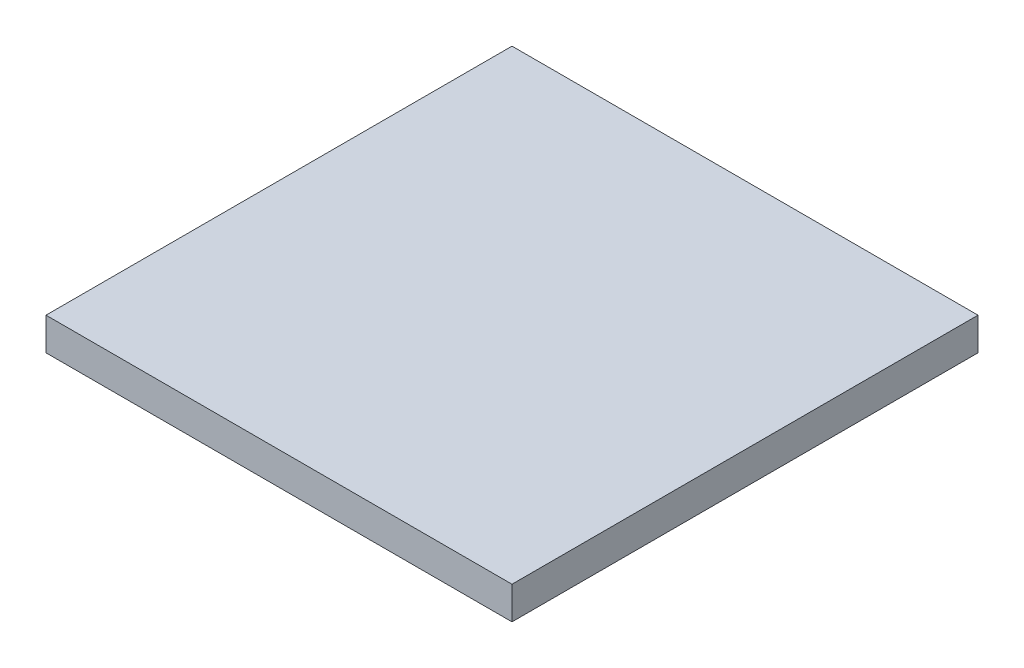
ISO-10303-21;
HEADER;
FILE_DESCRIPTION(('STEP AP214'),'2;1');
FILE_NAME('part.step','',(''),(''),'','','');
FILE_SCHEMA(('AUTOMOTIVE_DESIGN { 1 0 10303 214 1 1 1 1 }'));
ENDSEC;
DATA;
#1=APPLICATION_CONTEXT('core data for automotive mechanical design processes');
#2=APPLICATION_PROTOCOL_DEFINITION('international standard','automotive_design',2000,#1);
#3=PRODUCT_CONTEXT('',#1,'mechanical');
#4=PRODUCT('Part','Part','',(#3));
#5=PRODUCT_RELATED_PRODUCT_CATEGORY('part','',(#4));
#6=PRODUCT_DEFINITION_FORMATION('','',#4);
#7=PRODUCT_DEFINITION_CONTEXT('part definition',#1,'design');
#8=PRODUCT_DEFINITION('design','',#6,#7);
#9=PRODUCT_DEFINITION_SHAPE('','',#8);
#10=(LENGTH_UNIT() NAMED_UNIT(*) SI_UNIT(.MILLI.,.METRE.));
#11=(NAMED_UNIT(*) PLANE_ANGLE_UNIT() SI_UNIT($,.RADIAN.));
#12=(NAMED_UNIT(*) SI_UNIT($,.STERADIAN.) SOLID_ANGLE_UNIT());
#13=UNCERTAINTY_MEASURE_WITH_UNIT(LENGTH_MEASURE(1.E-05),#10,'distance_accuracy_value','');
#14=(GEOMETRIC_REPRESENTATION_CONTEXT(3) GLOBAL_UNCERTAINTY_ASSIGNED_CONTEXT((#13)) GLOBAL_UNIT_ASSIGNED_CONTEXT((#10,
#11,#12)) REPRESENTATION_CONTEXT('',''));
#15=CARTESIAN_POINT('',(0.,0.,0.));
#16=DIRECTION('',(0.,0.,1.));
#17=DIRECTION('',(1.,0.,0.));
#18=AXIS2_PLACEMENT_3D('',#15,#16,#17);
#19=CARTESIAN_POINT('',(1000.,0.,0.));
#20=DIRECTION('',(0.,0.,-1.));
#21=DIRECTION('',(-1.,0.,0.));
#22=AXIS2_PLACEMENT_3D('',#19,#20,#21);
#23=PLANE('',#22);
#24=DIRECTION('',(0.,-1.,0.));
#25=VECTOR('',#24,1.);
#26=CARTESIAN_POINT('',(0.,0.,0.));
#27=LINE('',#26,#25);
#28=CARTESIAN_POINT('',(0.,70.,0.));
#29=VERTEX_POINT('',#28);
#30=CARTESIAN_POINT('',(0.,0.,0.));
#31=VERTEX_POINT('',#30);
#32=EDGE_CURVE('E107',#29,#31,#27,.T.);
#33=ORIENTED_EDGE('',*,*,#32,.T.);
#34=DIRECTION('',(-1.,0.,0.));
#35=VECTOR('',#34,1.);
#36=CARTESIAN_POINT('',(1000.,0.,0.));
#37=LINE('',#36,#35);
#38=CARTESIAN_POINT('',(1000.,0.,0.));
#39=VERTEX_POINT('',#38);
#40=EDGE_CURVE('E11',#39,#31,#37,.T.);
#41=ORIENTED_EDGE('',*,*,#40,.F.);
#42=DIRECTION('',(0.,-1.,0.));
#43=VECTOR('',#42,1.);
#44=CARTESIAN_POINT('',(1000.,0.,0.));
#45=LINE('',#44,#43);
#46=CARTESIAN_POINT('',(1000.,70.,0.));
#47=VERTEX_POINT('',#46);
#48=EDGE_CURVE('E91',#47,#39,#45,.T.);
#49=ORIENTED_EDGE('',*,*,#48,.F.);
#50=DIRECTION('',(-1.,0.,0.));
#51=VECTOR('',#50,1.);
#52=CARTESIAN_POINT('',(1000.,70.,0.));
#53=LINE('',#52,#51);
#54=EDGE_CURVE('E103',#47,#29,#53,.T.);
#55=ORIENTED_EDGE('',*,*,#54,.T.);
#56=EDGE_LOOP('',(#33,#41,#49,#55));
#57=FACE_BOUND('',#56,.T.);
#58=ADVANCED_FACE('F39',(#57),#23,.F.);
#59=CARTESIAN_POINT('',(1000.,0.,0.));
#60=DIRECTION('',(0.,1.,0.));
#61=DIRECTION('',(0.,0.,1.));
#62=AXIS2_PLACEMENT_3D('',#59,#60,#61);
#63=PLANE('',#62);
#64=DIRECTION('',(0.,0.,-1.));
#65=VECTOR('',#64,1.);
#66=CARTESIAN_POINT('',(0.,0.,0.));
#67=LINE('',#66,#65);
#68=CARTESIAN_POINT('',(0.,0.,-1000.));
#69=VERTEX_POINT('',#68);
#70=EDGE_CURVE('E96',#31,#69,#67,.T.);
#71=ORIENTED_EDGE('',*,*,#70,.T.);
#72=DIRECTION('',(-1.,0.,0.));
#73=VECTOR('',#72,1.);
#74=CARTESIAN_POINT('',(1000.,0.,-1000.));
#75=LINE('',#74,#73);
#76=CARTESIAN_POINT('',(1000.,0.,-1000.));
#77=VERTEX_POINT('',#76);
#78=EDGE_CURVE('E48',#77,#69,#75,.T.);
#79=ORIENTED_EDGE('',*,*,#78,.F.);
#80=DIRECTION('',(0.,0.,-1.));
#81=VECTOR('',#80,1.);
#82=CARTESIAN_POINT('',(1000.,0.,0.));
#83=LINE('',#82,#81);
#84=EDGE_CURVE('E86',#39,#77,#83,.T.);
#85=ORIENTED_EDGE('',*,*,#84,.F.);
#86=ORIENTED_EDGE('',*,*,#40,.T.);
#87=EDGE_LOOP('',(#71,#79,#85,#86));
#88=FACE_BOUND('',#87,.T.);
#89=ADVANCED_FACE('F95',(#88),#63,.F.);
#90=CARTESIAN_POINT('',(1000.,0.,-1000.));
#91=DIRECTION('',(0.,0.,1.));
#92=DIRECTION('',(1.,0.,0.));
#93=AXIS2_PLACEMENT_3D('',#90,#91,#92);
#94=PLANE('',#93);
#95=DIRECTION('',(0.,1.,0.));
#96=VECTOR('',#95,1.);
#97=CARTESIAN_POINT('',(0.,0.,-1000.));
#98=LINE('',#97,#96);
#99=CARTESIAN_POINT('',(0.,70.,-1000.));
#100=VERTEX_POINT('',#99);
#101=EDGE_CURVE('E73',#69,#100,#98,.T.);
#102=ORIENTED_EDGE('',*,*,#101,.T.);
#103=DIRECTION('',(-1.,0.,0.));
#104=VECTOR('',#103,1.);
#105=CARTESIAN_POINT('',(1000.,70.,-1000.));
#106=LINE('',#105,#104);
#107=CARTESIAN_POINT('',(1000.,70.,-1000.));
#108=VERTEX_POINT('',#107);
#109=EDGE_CURVE('E98',#108,#100,#106,.T.);
#110=ORIENTED_EDGE('',*,*,#109,.F.);
#111=DIRECTION('',(0.,1.,0.));
#112=VECTOR('',#111,1.);
#113=CARTESIAN_POINT('',(1000.,0.,-1000.));
#114=LINE('',#113,#112);
#115=EDGE_CURVE('E89',#77,#108,#114,.T.);
#116=ORIENTED_EDGE('',*,*,#115,.F.);
#117=ORIENTED_EDGE('',*,*,#78,.T.);
#118=EDGE_LOOP('',(#102,#110,#116,#117));
#119=FACE_BOUND('',#118,.T.);
#120=ADVANCED_FACE('F99',(#119),#94,.F.);
#121=CARTESIAN_POINT('',(1000.,70.,0.));
#122=DIRECTION('',(0.,-1.,0.));
#123=DIRECTION('',(0.,0.,-1.));
#124=AXIS2_PLACEMENT_3D('',#121,#122,#123);
#125=PLANE('',#124);
#126=DIRECTION('',(0.,0.,1.));
#127=VECTOR('',#126,1.);
#128=CARTESIAN_POINT('',(0.,70.,0.));
#129=LINE('',#128,#127);
#130=EDGE_CURVE('E79',#100,#29,#129,.T.);
#131=ORIENTED_EDGE('',*,*,#130,.T.);
#132=ORIENTED_EDGE('',*,*,#54,.F.);
#133=DIRECTION('',(0.,0.,1.));
#134=VECTOR('',#133,1.);
#135=CARTESIAN_POINT('',(1000.,70.,0.));
#136=LINE('',#135,#134);
#137=EDGE_CURVE('E56',#108,#47,#136,.T.);
#138=ORIENTED_EDGE('',*,*,#137,.F.);
#139=ORIENTED_EDGE('',*,*,#109,.T.);
#140=EDGE_LOOP('',(#131,#132,#138,#139));
#141=FACE_BOUND('',#140,.T.);
#142=ADVANCED_FACE('F120',(#141),#125,.F.);
#143=CARTESIAN_POINT('',(1000.,0.,0.));
#144=DIRECTION('',(-1.,0.,0.));
#145=DIRECTION('',(0.,0.,1.));
#146=AXIS2_PLACEMENT_3D('',#143,#144,#145);
#147=PLANE('',#146);
#148=ORIENTED_EDGE('',*,*,#48,.T.);
#149=ORIENTED_EDGE('',*,*,#84,.T.);
#150=ORIENTED_EDGE('',*,*,#115,.T.);
#151=ORIENTED_EDGE('',*,*,#137,.T.);
#152=EDGE_LOOP('',(#148,#149,#150,#151));
#153=FACE_BOUND('',#152,.T.);
#154=ADVANCED_FACE('F87',(#153),#147,.F.);
#155=CARTESIAN_POINT('',(0.,0.,0.));
#156=DIRECTION('',(-1.,0.,0.));
#157=DIRECTION('',(0.,0.,1.));
#158=AXIS2_PLACEMENT_3D('',#155,#156,#157);
#159=PLANE('',#158);
#160=ORIENTED_EDGE('',*,*,#32,.F.);
#161=ORIENTED_EDGE('',*,*,#130,.F.);
#162=ORIENTED_EDGE('',*,*,#101,.F.);
#163=ORIENTED_EDGE('',*,*,#70,.F.);
#164=EDGE_LOOP('',(#160,#161,#162,#163));
#165=FACE_BOUND('',#164,.T.);
#166=ADVANCED_FACE('F123',(#165),#159,.T.);
#167=CLOSED_SHELL('',(#58,#89,#120,#142,#154,#166));
#168=MANIFOLD_SOLID_BREP('B2',#167);
#169=ADVANCED_BREP_SHAPE_REPRESENTATION('',(#18,#168),#14);
#170=SHAPE_DEFINITION_REPRESENTATION(#9,#169);
ENDSEC;
END-ISO-10303-21;
